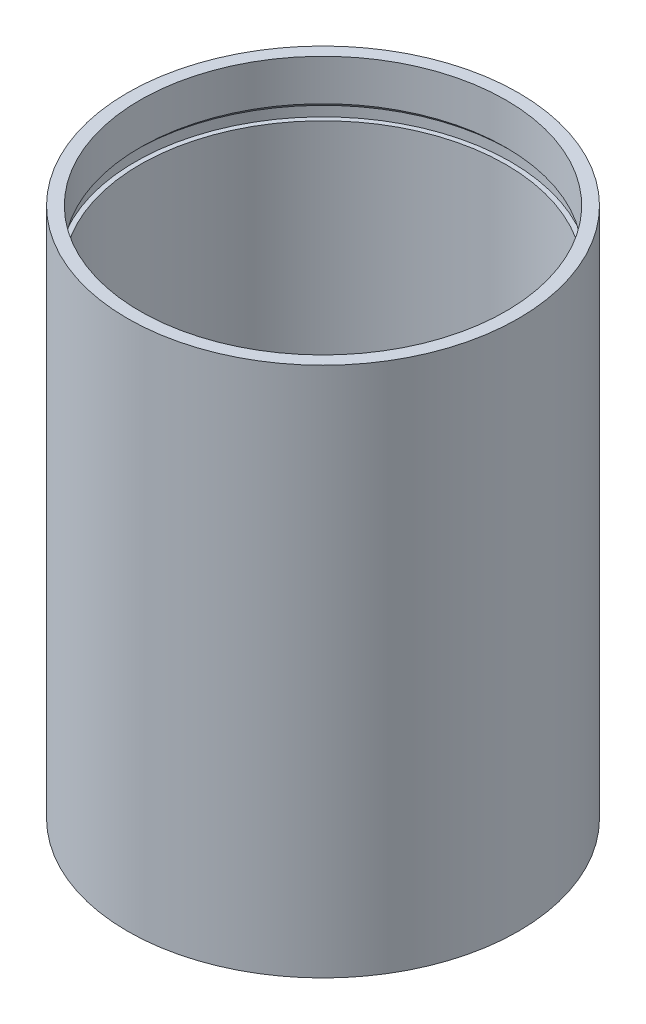
ISO-10303-21;
HEADER;
FILE_DESCRIPTION(('STEP AP214'),'2;1');
FILE_NAME('part.step','',(''),(''),'','','');
FILE_SCHEMA(('AUTOMOTIVE_DESIGN { 1 0 10303 214 1 1 1 1 }'));
ENDSEC;
DATA;
#1=APPLICATION_CONTEXT('core data for automotive mechanical design processes');
#2=APPLICATION_PROTOCOL_DEFINITION('international standard','automotive_design',2000,#1);
#3=PRODUCT_CONTEXT('',#1,'mechanical');
#4=PRODUCT('Part','Part','',(#3));
#5=PRODUCT_RELATED_PRODUCT_CATEGORY('part','',(#4));
#6=PRODUCT_DEFINITION_FORMATION('','',#4);
#7=PRODUCT_DEFINITION_CONTEXT('part definition',#1,'design');
#8=PRODUCT_DEFINITION('design','',#6,#7);
#9=PRODUCT_DEFINITION_SHAPE('','',#8);
#10=(LENGTH_UNIT() NAMED_UNIT(*) SI_UNIT(.MILLI.,.METRE.));
#11=(NAMED_UNIT(*) PLANE_ANGLE_UNIT() SI_UNIT($,.RADIAN.));
#12=(NAMED_UNIT(*) SI_UNIT($,.STERADIAN.) SOLID_ANGLE_UNIT());
#13=UNCERTAINTY_MEASURE_WITH_UNIT(LENGTH_MEASURE(1.E-05),#10,'distance_accuracy_value','');
#14=(GEOMETRIC_REPRESENTATION_CONTEXT(3) GLOBAL_UNCERTAINTY_ASSIGNED_CONTEXT((#13)) GLOBAL_UNIT_ASSIGNED_CONTEXT((#10,
#11,#12)) REPRESENTATION_CONTEXT('',''));
#15=CARTESIAN_POINT('',(0.,0.,0.));
#16=DIRECTION('',(0.,0.,1.));
#17=DIRECTION('',(1.,0.,0.));
#18=AXIS2_PLACEMENT_3D('',#15,#16,#17);
#19=CARTESIAN_POINT('',(-45.85,52.5,0.));
#20=DIRECTION('',(0.,-1.,0.));
#21=DIRECTION('',(0.,0.,-1.));
#22=AXIS2_PLACEMENT_3D('',#19,#20,#21);
#23=PLANE('',#22);
#24=CARTESIAN_POINT('',(0.,52.5,0.));
#25=DIRECTION('',(0.,-1.,0.));
#26=DIRECTION('',(0.,0.,-1.));
#27=AXIS2_PLACEMENT_3D('',#24,#25,#26);
#28=CIRCLE('',#27,47.05);
#29=CARTESIAN_POINT('',(0.,52.5,-47.05));
#30=VERTEX_POINT('',#29);
#31=EDGE_CURVE('E88',#30,#30,#28,.T.);
#32=ORIENTED_EDGE('',*,*,#31,.F.);
#33=EDGE_LOOP('',(#32));
#34=FACE_BOUND('',#33,.T.);
#35=CARTESIAN_POINT('',(0.,52.5,0.));
#36=DIRECTION('',(0.,-1.,0.));
#37=DIRECTION('',(0.,0.,-1.));
#38=AXIS2_PLACEMENT_3D('',#35,#36,#37);
#39=CIRCLE('',#38,45.85);
#40=CARTESIAN_POINT('',(0.,52.5,-45.85));
#41=VERTEX_POINT('',#40);
#42=EDGE_CURVE('E10',#41,#41,#39,.T.);
#43=ORIENTED_EDGE('',*,*,#42,.T.);
#44=EDGE_LOOP('',(#43));
#45=FACE_BOUND('',#44,.T.);
#46=ADVANCED_FACE('F37',(#34,#45),#23,.F.);
#47=CARTESIAN_POINT('',(0.,0.,0.));
#48=DIRECTION('',(0.,-1.,0.));
#49=DIRECTION('',(0.,0.,-1.));
#50=AXIS2_PLACEMENT_3D('',#47,#48,#49);
#51=CYLINDRICAL_SURFACE('',#50,45.85);
#52=ORIENTED_EDGE('',*,*,#42,.F.);
#53=EDGE_LOOP('',(#52));
#54=FACE_BOUND('',#53,.T.);
#55=CARTESIAN_POINT('',(0.,-52.5,0.));
#56=DIRECTION('',(0.,-1.,0.));
#57=DIRECTION('',(0.,0.,-1.));
#58=AXIS2_PLACEMENT_3D('',#55,#56,#57);
#59=CIRCLE('',#58,45.85);
#60=CARTESIAN_POINT('',(0.,-52.5,-45.85));
#61=VERTEX_POINT('',#60);
#62=EDGE_CURVE('E44',#61,#61,#59,.T.);
#63=ORIENTED_EDGE('',*,*,#62,.T.);
#64=EDGE_LOOP('',(#63));
#65=FACE_BOUND('',#64,.T.);
#66=ADVANCED_FACE('F96',(#54,#65),#51,.F.);
#67=CARTESIAN_POINT('',(-45.85,-52.5,0.));
#68=DIRECTION('',(0.,1.,0.));
#69=DIRECTION('',(0.,0.,1.));
#70=AXIS2_PLACEMENT_3D('',#67,#68,#69);
#71=PLANE('',#70);
#72=ORIENTED_EDGE('',*,*,#62,.F.);
#73=EDGE_LOOP('',(#72));
#74=FACE_BOUND('',#73,.T.);
#75=CARTESIAN_POINT('',(0.,-52.5,0.));
#76=DIRECTION('',(0.,-1.,0.));
#77=DIRECTION('',(0.,0.,-1.));
#78=AXIS2_PLACEMENT_3D('',#75,#76,#77);
#79=CIRCLE('',#78,47.05);
#80=CARTESIAN_POINT('',(0.,-52.5,-47.05));
#81=VERTEX_POINT('',#80);
#82=EDGE_CURVE('E49',#81,#81,#79,.T.);
#83=ORIENTED_EDGE('',*,*,#82,.T.);
#84=EDGE_LOOP('',(#83));
#85=FACE_BOUND('',#84,.T.);
#86=ADVANCED_FACE('F100',(#74,#85),#71,.F.);
#87=CARTESIAN_POINT('',(0.,0.,0.));
#88=DIRECTION('',(0.,-1.,0.));
#89=DIRECTION('',(0.,0.,-1.));
#90=AXIS2_PLACEMENT_3D('',#87,#88,#89);
#91=CYLINDRICAL_SURFACE('',#90,47.05);
#92=ORIENTED_EDGE('',*,*,#82,.F.);
#93=EDGE_LOOP('',(#92));
#94=FACE_BOUND('',#93,.T.);
#95=CARTESIAN_POINT('',(0.,-55.,0.));
#96=DIRECTION('',(0.,-1.,0.));
#97=DIRECTION('',(0.,0.,-1.));
#98=AXIS2_PLACEMENT_3D('',#95,#96,#97);
#99=CIRCLE('',#98,47.05);
#100=CARTESIAN_POINT('',(0.,-55.,-47.05));
#101=VERTEX_POINT('',#100);
#102=EDGE_CURVE('E54',#101,#101,#99,.T.);
#103=ORIENTED_EDGE('',*,*,#102,.T.);
#104=EDGE_LOOP('',(#103));
#105=FACE_BOUND('',#104,.T.);
#106=ADVANCED_FACE('F105',(#94,#105),#91,.F.);
#107=CARTESIAN_POINT('',(0.,-56.2,0.));
#108=DIRECTION('',(0.,1.,0.));
#109=DIRECTION('',(0.,0.,1.));
#110=AXIS2_PLACEMENT_3D('',#107,#108,#109);
#111=CONICAL_SURFACE('',#110,45.85,0.785398163397445);
#112=ORIENTED_EDGE('',*,*,#102,.F.);
#113=EDGE_LOOP('',(#112));
#114=FACE_BOUND('',#113,.T.);
#115=CARTESIAN_POINT('',(0.,-56.2,0.));
#116=DIRECTION('',(0.,-1.,0.));
#117=DIRECTION('',(0.,0.,-1.));
#118=AXIS2_PLACEMENT_3D('',#115,#116,#117);
#119=CIRCLE('',#118,45.85);
#120=CARTESIAN_POINT('',(0.,-56.2,-45.85));
#121=VERTEX_POINT('',#120);
#122=EDGE_CURVE('E60',#121,#121,#119,.T.);
#123=ORIENTED_EDGE('',*,*,#122,.T.);
#124=EDGE_LOOP('',(#123));
#125=FACE_BOUND('',#124,.T.);
#126=ADVANCED_FACE('F111',(#114,#125),#111,.F.);
#127=CARTESIAN_POINT('',(0.,0.,0.));
#128=DIRECTION('',(0.,-1.,0.));
#129=DIRECTION('',(0.,0.,-1.));
#130=AXIS2_PLACEMENT_3D('',#127,#128,#129);
#131=CYLINDRICAL_SURFACE('',#130,45.85);
#132=ORIENTED_EDGE('',*,*,#122,.F.);
#133=EDGE_LOOP('',(#132));
#134=FACE_BOUND('',#133,.T.);
#135=CARTESIAN_POINT('',(0.,-66.5,0.));
#136=DIRECTION('',(0.,-1.,0.));
#137=DIRECTION('',(0.,0.,-1.));
#138=AXIS2_PLACEMENT_3D('',#135,#136,#137);
#139=CIRCLE('',#138,45.85);
#140=CARTESIAN_POINT('',(0.,-66.5,-45.85));
#141=VERTEX_POINT('',#140);
#142=EDGE_CURVE('E64',#141,#141,#139,.T.);
#143=ORIENTED_EDGE('',*,*,#142,.T.);
#144=EDGE_LOOP('',(#143));
#145=FACE_BOUND('',#144,.T.);
#146=ADVANCED_FACE('F115',(#134,#145),#131,.F.);
#147=CARTESIAN_POINT('',(-45.85,-66.5,0.));
#148=DIRECTION('',(0.,1.,0.));
#149=DIRECTION('',(0.,0.,1.));
#150=AXIS2_PLACEMENT_3D('',#147,#148,#149);
#151=PLANE('',#150);
#152=ORIENTED_EDGE('',*,*,#142,.F.);
#153=EDGE_LOOP('',(#152));
#154=FACE_BOUND('',#153,.T.);
#155=CARTESIAN_POINT('',(0.,-66.5,0.));
#156=DIRECTION('',(0.,-1.,0.));
#157=DIRECTION('',(0.,0.,-1.));
#158=AXIS2_PLACEMENT_3D('',#155,#156,#157);
#159=CIRCLE('',#158,49.);
#160=CARTESIAN_POINT('',(0.,-66.5,-49.));
#161=VERTEX_POINT('',#160);
#162=EDGE_CURVE('E68',#161,#161,#159,.T.);
#163=ORIENTED_EDGE('',*,*,#162,.T.);
#164=EDGE_LOOP('',(#163));
#165=FACE_BOUND('',#164,.T.);
#166=ADVANCED_FACE('F119',(#154,#165),#151,.F.);
#167=CARTESIAN_POINT('',(0.,0.,0.));
#168=DIRECTION('',(0.,-1.,0.));
#169=DIRECTION('',(0.,0.,-1.));
#170=AXIS2_PLACEMENT_3D('',#167,#168,#169);
#171=CYLINDRICAL_SURFACE('',#170,49.);
#172=ORIENTED_EDGE('',*,*,#162,.F.);
#173=EDGE_LOOP('',(#172));
#174=FACE_BOUND('',#173,.T.);
#175=CARTESIAN_POINT('',(0.,66.5,0.));
#176=DIRECTION('',(0.,-1.,0.));
#177=DIRECTION('',(0.,0.,-1.));
#178=AXIS2_PLACEMENT_3D('',#175,#176,#177);
#179=CIRCLE('',#178,49.);
#180=CARTESIAN_POINT('',(0.,66.5,-49.));
#181=VERTEX_POINT('',#180);
#182=EDGE_CURVE('E72',#181,#181,#179,.T.);
#183=ORIENTED_EDGE('',*,*,#182,.T.);
#184=EDGE_LOOP('',(#183));
#185=FACE_BOUND('',#184,.T.);
#186=ADVANCED_FACE('F123',(#174,#185),#171,.T.);
#187=CARTESIAN_POINT('',(-45.85,66.5,0.));
#188=DIRECTION('',(0.,-1.,0.));
#189=DIRECTION('',(0.,0.,-1.));
#190=AXIS2_PLACEMENT_3D('',#187,#188,#189);
#191=PLANE('',#190);
#192=ORIENTED_EDGE('',*,*,#182,.F.);
#193=EDGE_LOOP('',(#192));
#194=FACE_BOUND('',#193,.T.);
#195=CARTESIAN_POINT('',(0.,66.5,0.));
#196=DIRECTION('',(0.,-1.,0.));
#197=DIRECTION('',(0.,0.,-1.));
#198=AXIS2_PLACEMENT_3D('',#195,#196,#197);
#199=CIRCLE('',#198,45.85);
#200=CARTESIAN_POINT('',(0.,66.5,-45.85));
#201=VERTEX_POINT('',#200);
#202=EDGE_CURVE('E76',#201,#201,#199,.T.);
#203=ORIENTED_EDGE('',*,*,#202,.T.);
#204=EDGE_LOOP('',(#203));
#205=FACE_BOUND('',#204,.T.);
#206=ADVANCED_FACE('F127',(#194,#205),#191,.F.);
#207=CARTESIAN_POINT('',(0.,0.,0.));
#208=DIRECTION('',(0.,-1.,0.));
#209=DIRECTION('',(0.,0.,-1.));
#210=AXIS2_PLACEMENT_3D('',#207,#208,#209);
#211=CYLINDRICAL_SURFACE('',#210,45.85);
#212=ORIENTED_EDGE('',*,*,#202,.F.);
#213=EDGE_LOOP('',(#212));
#214=FACE_BOUND('',#213,.T.);
#215=CARTESIAN_POINT('',(0.,56.2,0.));
#216=DIRECTION('',(0.,-1.,0.));
#217=DIRECTION('',(0.,0.,-1.));
#218=AXIS2_PLACEMENT_3D('',#215,#216,#217);
#219=CIRCLE('',#218,45.85);
#220=CARTESIAN_POINT('',(0.,56.2,-45.85));
#221=VERTEX_POINT('',#220);
#222=EDGE_CURVE('E80',#221,#221,#219,.T.);
#223=ORIENTED_EDGE('',*,*,#222,.T.);
#224=EDGE_LOOP('',(#223));
#225=FACE_BOUND('',#224,.T.);
#226=ADVANCED_FACE('F131',(#214,#225),#211,.F.);
#227=CARTESIAN_POINT('',(0.,55.,0.));
#228=DIRECTION('',(0.,-1.,0.));
#229=DIRECTION('',(0.,0.,-1.));
#230=AXIS2_PLACEMENT_3D('',#227,#228,#229);
#231=CONICAL_SURFACE('',#230,47.05,0.785398163397445);
#232=ORIENTED_EDGE('',*,*,#222,.F.);
#233=EDGE_LOOP('',(#232));
#234=FACE_BOUND('',#233,.T.);
#235=CARTESIAN_POINT('',(0.,55.,0.));
#236=DIRECTION('',(0.,-1.,0.));
#237=DIRECTION('',(0.,0.,-1.));
#238=AXIS2_PLACEMENT_3D('',#235,#236,#237);
#239=CIRCLE('',#238,47.05);
#240=CARTESIAN_POINT('',(0.,55.,-47.05));
#241=VERTEX_POINT('',#240);
#242=EDGE_CURVE('E84',#241,#241,#239,.T.);
#243=ORIENTED_EDGE('',*,*,#242,.T.);
#244=EDGE_LOOP('',(#243));
#245=FACE_BOUND('',#244,.T.);
#246=ADVANCED_FACE('F135',(#234,#245),#231,.F.);
#247=CARTESIAN_POINT('',(0.,0.,0.));
#248=DIRECTION('',(0.,-1.,0.));
#249=DIRECTION('',(0.,0.,-1.));
#250=AXIS2_PLACEMENT_3D('',#247,#248,#249);
#251=CYLINDRICAL_SURFACE('',#250,47.05);
#252=ORIENTED_EDGE('',*,*,#242,.F.);
#253=EDGE_LOOP('',(#252));
#254=FACE_BOUND('',#253,.T.);
#255=ORIENTED_EDGE('',*,*,#31,.T.);
#256=EDGE_LOOP('',(#255));
#257=FACE_BOUND('',#256,.T.);
#258=ADVANCED_FACE('F93',(#254,#257),#251,.F.);
#259=CLOSED_SHELL('',(#46,#66,#86,#106,#126,#146,#166,#186,#206,#226,#246,#258));
#260=MANIFOLD_SOLID_BREP('B2',#259);
#261=ADVANCED_BREP_SHAPE_REPRESENTATION('',(#18,#260),#14);
#262=SHAPE_DEFINITION_REPRESENTATION(#9,#261);
ENDSEC;
END-ISO-10303-21;
